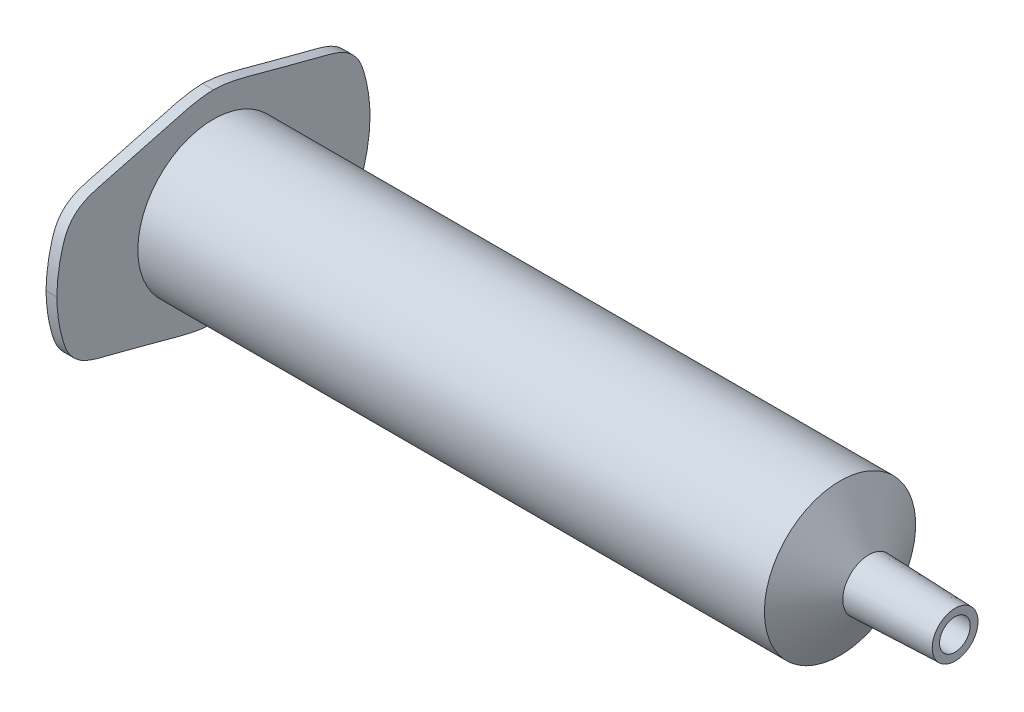
ISO-10303-21;
HEADER;
FILE_DESCRIPTION(('STEP AP214'),'2;1');
FILE_NAME('part.step','',(''),(''),'','','');
FILE_SCHEMA(('AUTOMOTIVE_DESIGN { 1 0 10303 214 1 1 1 1 }'));
ENDSEC;
DATA;
#1=APPLICATION_CONTEXT('core data for automotive mechanical design processes');
#2=APPLICATION_PROTOCOL_DEFINITION('international standard','automotive_design',2000,#1);
#3=PRODUCT_CONTEXT('',#1,'mechanical');
#4=PRODUCT('Part','Part','',(#3));
#5=PRODUCT_RELATED_PRODUCT_CATEGORY('part','',(#4));
#6=PRODUCT_DEFINITION_FORMATION('','',#4);
#7=PRODUCT_DEFINITION_CONTEXT('part definition',#1,'design');
#8=PRODUCT_DEFINITION('design','',#6,#7);
#9=PRODUCT_DEFINITION_SHAPE('','',#8);
#10=(LENGTH_UNIT() NAMED_UNIT(*) SI_UNIT(.MILLI.,.METRE.));
#11=(NAMED_UNIT(*) PLANE_ANGLE_UNIT() SI_UNIT($,.RADIAN.));
#12=(NAMED_UNIT(*) SI_UNIT($,.STERADIAN.) SOLID_ANGLE_UNIT());
#13=UNCERTAINTY_MEASURE_WITH_UNIT(LENGTH_MEASURE(1.E-05),#10,'distance_accuracy_value','');
#14=(GEOMETRIC_REPRESENTATION_CONTEXT(3) GLOBAL_UNCERTAINTY_ASSIGNED_CONTEXT((#13)) GLOBAL_UNIT_ASSIGNED_CONTEXT((#10,
#11,#12)) REPRESENTATION_CONTEXT('',''));
#15=CARTESIAN_POINT('',(0.,0.,0.));
#16=DIRECTION('',(0.,0.,1.));
#17=DIRECTION('',(1.,0.,0.));
#18=AXIS2_PLACEMENT_3D('',#15,#16,#17);
#19=CARTESIAN_POINT('',(18.9012216331777,0.,0.));
#20=DIRECTION('',(-1.,0.,0.));
#21=DIRECTION('',(0.,0.,1.));
#22=AXIS2_PLACEMENT_3D('',#19,#20,#21);
#23=CONICAL_SURFACE('',#22,1.71396799592597,0.0349065850398859);
#24=CARTESIAN_POINT('',(27.2890016001266,0.,0.));
#25=DIRECTION('',(-1.,0.,0.));
#26=DIRECTION('',(0.,0.,1.));
#27=AXIS2_PLACEMENT_3D('',#24,#25,#26);
#28=CIRCLE('',#27,1.42106026515266);
#29=CARTESIAN_POINT('',(27.2890016001266,0.,1.42106026515266));
#30=VERTEX_POINT('',#29);
#31=EDGE_CURVE('E176',#30,#30,#28,.T.);
#32=ORIENTED_EDGE('',*,*,#31,.F.);
#33=EDGE_LOOP('',(#32));
#34=FACE_BOUND('',#33,.T.);
#35=CARTESIAN_POINT('',(18.9012216331777,0.,0.));
#36=DIRECTION('',(-1.,0.,0.));
#37=DIRECTION('',(0.,0.,1.));
#38=AXIS2_PLACEMENT_3D('',#35,#36,#37);
#39=CIRCLE('',#38,1.71396799592597);
#40=CARTESIAN_POINT('',(18.9012216331777,0.,1.71396799592597));
#41=VERTEX_POINT('',#40);
#42=EDGE_CURVE('E11',#41,#41,#39,.T.);
#43=ORIENTED_EDGE('',*,*,#42,.T.);
#44=EDGE_LOOP('',(#43));
#45=FACE_BOUND('',#44,.T.);
#46=ADVANCED_FACE('F40',(#34,#45),#23,.F.);
#47=CARTESIAN_POINT('',(16.2534748211133,0.,0.));
#48=DIRECTION('',(-1.,0.,0.));
#49=DIRECTION('',(0.,0.,1.));
#50=AXIS2_PLACEMENT_3D('',#47,#48,#49);
#51=CONICAL_SURFACE('',#50,6.3,1.0471975511966);
#52=ORIENTED_EDGE('',*,*,#42,.F.);
#53=EDGE_LOOP('',(#52));
#54=FACE_BOUND('',#53,.T.);
#55=CARTESIAN_POINT('',(16.2534748211133,0.,0.));
#56=DIRECTION('',(-1.,0.,0.));
#57=DIRECTION('',(0.,0.,1.));
#58=AXIS2_PLACEMENT_3D('',#55,#56,#57);
#59=CIRCLE('',#58,6.3);
#60=CARTESIAN_POINT('',(16.2534748211133,0.,6.3));
#61=VERTEX_POINT('',#60);
#62=EDGE_CURVE('E48',#61,#61,#59,.T.);
#63=ORIENTED_EDGE('',*,*,#62,.T.);
#64=EDGE_LOOP('',(#63));
#65=FACE_BOUND('',#64,.T.);
#66=ADVANCED_FACE('F193',(#54,#65),#51,.F.);
#67=CARTESIAN_POINT('',(-11.5652905987812,0.,0.));
#68=DIRECTION('',(-1.,0.,0.));
#69=DIRECTION('',(0.,0.,1.));
#70=AXIS2_PLACEMENT_3D('',#67,#68,#69);
#71=CYLINDRICAL_SURFACE('',#70,6.3);
#72=ORIENTED_EDGE('',*,*,#62,.F.);
#73=EDGE_LOOP('',(#72));
#74=FACE_BOUND('',#73,.T.);
#75=CARTESIAN_POINT('',(-42.342379990454,0.,0.));
#76=DIRECTION('',(-1.,0.,0.));
#77=DIRECTION('',(0.,0.,1.));
#78=AXIS2_PLACEMENT_3D('',#75,#76,#77);
#79=CIRCLE('',#78,6.3);
#80=CARTESIAN_POINT('',(-42.342379990454,0.,6.3));
#81=VERTEX_POINT('',#80);
#82=EDGE_CURVE('E139',#81,#81,#79,.T.);
#83=ORIENTED_EDGE('',*,*,#82,.T.);
#84=EDGE_LOOP('',(#83));
#85=FACE_BOUND('',#84,.T.);
#86=ADVANCED_FACE('F195',(#74,#85),#71,.F.);
#87=CARTESIAN_POINT('',(-11.5652905987812,0.,0.));
#88=DIRECTION('',(-1.,0.,0.));
#89=DIRECTION('',(0.,0.,1.));
#90=AXIS2_PLACEMENT_3D('',#87,#88,#89);
#91=CYLINDRICAL_SURFACE('',#90,7.);
#92=CARTESIAN_POINT('',(16.657620009546,0.,0.));
#93=DIRECTION('',(-1.,0.,0.));
#94=DIRECTION('',(0.,0.,1.));
#95=AXIS2_PLACEMENT_3D('',#92,#93,#94);
#96=CIRCLE('',#95,7.);
#97=CARTESIAN_POINT('',(16.657620009546,0.,7.));
#98=VERTEX_POINT('',#97);
#99=EDGE_CURVE('E185',#98,#98,#96,.T.);
#100=ORIENTED_EDGE('',*,*,#99,.T.);
#101=EDGE_LOOP('',(#100));
#102=FACE_BOUND('',#101,.T.);
#103=CARTESIAN_POINT('',(-41.342379990454,0.,0.));
#104=DIRECTION('',(-1.,0.,0.));
#105=DIRECTION('',(0.,0.,1.));
#106=AXIS2_PLACEMENT_3D('',#103,#104,#105);
#107=CIRCLE('',#106,7.);
#108=CARTESIAN_POINT('',(-41.342379990454,0.,7.));
#109=VERTEX_POINT('',#108);
#110=EDGE_CURVE('E188',#109,#109,#107,.T.);
#111=ORIENTED_EDGE('',*,*,#110,.F.);
#112=EDGE_LOOP('',(#111));
#113=FACE_BOUND('',#112,.T.);
#114=ADVANCED_FACE('F197',(#102,#113),#91,.T.);
#115=CARTESIAN_POINT('',(16.657620009546,0.,0.));
#116=DIRECTION('',(-1.,0.,0.));
#117=DIRECTION('',(0.,0.,1.));
#118=AXIS2_PLACEMENT_3D('',#115,#116,#117);
#119=CONICAL_SURFACE('',#118,7.,1.0471975511966);
#120=CARTESIAN_POINT('',(19.3134312478183,0.,0.));
#121=DIRECTION('',(-1.,0.,0.));
#122=DIRECTION('',(0.,0.,1.));
#123=AXIS2_PLACEMENT_3D('',#120,#121,#122);
#124=CIRCLE('',#123,2.4);
#125=CARTESIAN_POINT('',(19.3134312478183,0.,2.4));
#126=VERTEX_POINT('',#125);
#127=EDGE_CURVE('E182',#126,#126,#124,.T.);
#128=ORIENTED_EDGE('',*,*,#127,.T.);
#129=EDGE_LOOP('',(#128));
#130=FACE_BOUND('',#129,.T.);
#131=ORIENTED_EDGE('',*,*,#99,.F.);
#132=EDGE_LOOP('',(#131));
#133=FACE_BOUND('',#132,.T.);
#134=ADVANCED_FACE('F204',(#130,#133),#119,.T.);
#135=CARTESIAN_POINT('',(19.3134312478183,0.,0.));
#136=DIRECTION('',(-1.,0.,0.));
#137=DIRECTION('',(0.,0.,1.));
#138=AXIS2_PLACEMENT_3D('',#135,#136,#137);
#139=CONICAL_SURFACE('',#138,2.4,0.0349065850398859);
#140=CARTESIAN_POINT('',(27.3134312478183,0.,0.));
#141=DIRECTION('',(-1.,0.,0.));
#142=DIRECTION('',(0.,0.,1.));
#143=AXIS2_PLACEMENT_3D('',#140,#141,#142);
#144=CIRCLE('',#143,2.12063384406602);
#145=CARTESIAN_POINT('',(27.3134312478183,0.,2.12063384406602));
#146=VERTEX_POINT('',#145);
#147=EDGE_CURVE('E179',#146,#146,#144,.T.);
#148=ORIENTED_EDGE('',*,*,#147,.T.);
#149=EDGE_LOOP('',(#148));
#150=FACE_BOUND('',#149,.T.);
#151=ORIENTED_EDGE('',*,*,#127,.F.);
#152=EDGE_LOOP('',(#151));
#153=FACE_BOUND('',#152,.T.);
#154=ADVANCED_FACE('F218',(#150,#153),#139,.T.);
#155=CARTESIAN_POINT('',(27.3134312478183,0.,0.));
#156=DIRECTION('',(1.,0.,0.));
#157=DIRECTION('',(0.,0.,-1.));
#158=AXIS2_PLACEMENT_3D('',#155,#156,#157);
#159=CONICAL_SURFACE('',#158,2.12063384406602,1.53588974175502);
#160=ORIENTED_EDGE('',*,*,#31,.T.);
#161=EDGE_LOOP('',(#160));
#162=FACE_BOUND('',#161,.T.);
#163=ORIENTED_EDGE('',*,*,#147,.F.);
#164=EDGE_LOOP('',(#163));
#165=FACE_BOUND('',#164,.T.);
#166=ADVANCED_FACE('F133',(#162,#165),#159,.F.);
#167=CARTESIAN_POINT('',(-42.342379990454,7.14812112098861,9.49735171448007));
#168=DIRECTION('',(1.,0.,0.));
#169=DIRECTION('',(0.,0.,-1.));
#170=AXIS2_PLACEMENT_3D('',#167,#168,#169);
#171=PLANE('',#170);
#172=CARTESIAN_POINT('',(-42.342379990454,0.,14.5));
#173=CARTESIAN_POINT('',(-42.342379990454,1.25062948296168,14.4747287337964));
#174=CARTESIAN_POINT('',(-42.342379990454,3.01805845460226,14.2423280061506));
#175=CARTESIAN_POINT('',(-42.342379990454,5.15619286158089,13.4807262176049));
#176=CARTESIAN_POINT('',(-42.342379990454,6.24214820869177,12.3868883358726));
#177=CARTESIAN_POINT('',(-42.342379990454,6.72744437401259,11.1428383642192));
#178=CARTESIAN_POINT('',(-42.342379990454,7.12517911747974,9.56242027490795));
#179=CARTESIAN_POINT('',(-42.342379990454,7.69192172722433,7.48369388502889));
#180=CARTESIAN_POINT('',(-42.342379990454,8.36371994814103,4.7243913483052));
#181=CARTESIAN_POINT('',(-42.342379990454,9.12236681345111,2.26698944585392));
#182=CARTESIAN_POINT('',(-42.342379990454,9.33281421682711,0.655183078614348));
#183=CARTESIAN_POINT('',(-42.342379990454,9.35571143335815,0.0828452476058366));
#184=CARTESIAN_POINT('',(-42.342379990454,9.35788854192528,-1.99968167117032E-08));
#185=B_SPLINE_CURVE_WITH_KNOTS('',3,(#172,#173,#174,#175,#176,#177,#178,#179,#180,#181,#182,
#183,#184),.UNSPECIFIED.,.F.,.F.,(4,1,1,1,1,1,1,1,1,1,4),(0.,0.178779936700054,
0.255445114736818,0.319697761446917,0.392573489005963,0.443879083298232,0.553726463791617,
0.701162756448446,0.851190941881399,0.921407160798108,0.9332864030032),.UNSPECIFIED.);
#186=CARTESIAN_POINT('',(-42.342379990454,0.,14.5));
#187=VERTEX_POINT('',#186);
#188=CARTESIAN_POINT('',(-42.342379990454,9.35788854192528,-1.99968166933079E-08));
#189=VERTEX_POINT('',#188);
#190=EDGE_CURVE('E93',#187,#189,#185,.T.);
#191=ORIENTED_EDGE('',*,*,#190,.T.);
#192=CARTESIAN_POINT('',(-42.342379990454,9.35788854192528,-1.99968166933079E-08));
#193=CARTESIAN_POINT('',(-42.342379990454,9.35571143335814,-0.0828452875993035));
#194=CARTESIAN_POINT('',(-42.342379990454,9.33281469007736,-0.655182958783064));
#195=CARTESIAN_POINT('',(-42.342379990454,9.12236640364072,-2.26698955923304));
#196=CARTESIAN_POINT('',(-42.342379990454,8.36372008924576,-4.72439130790144));
#197=CARTESIAN_POINT('',(-42.342379990454,7.69192169836099,-7.48369389125443));
#198=CARTESIAN_POINT('',(-42.342379990454,7.125179122578,-9.56242027367162));
#199=CARTESIAN_POINT('',(-42.342379990454,6.72744436948187,-11.1428383621854));
#200=CARTESIAN_POINT('',(-42.342379990454,6.24214820092978,-12.3868883306955));
#201=CARTESIAN_POINT('',(-42.342379990454,5.15619285745482,-13.4807262081216));
#202=CARTESIAN_POINT('',(-42.342379990454,3.01805845556055,-14.2423280043153));
#203=CARTESIAN_POINT('',(-42.342379990454,1.25062948209032,-14.4747287271112));
#204=CARTESIAN_POINT('',(-42.342379990454,0.,-14.5));
#205=B_SPLINE_CURVE_WITH_KNOTS('',3,(#192,#193,#194,#195,#196,#197,#198,#199,#200,#201,#202,
#203,#204),.UNSPECIFIED.,.F.,.F.,(4,1,1,1,1,1,1,1,1,1,4),(0.,0.0118792422050917,
0.082095461121801,0.232123646554754,0.379559939211583,0.489407319704968,0.540712913997237,
0.613588641556282,0.677841288266382,0.754506466303146,0.9332864030032),.UNSPECIFIED.);
#206=CARTESIAN_POINT('',(-42.342379990454,0.,-14.5));
#207=VERTEX_POINT('',#206);
#208=EDGE_CURVE('E87',#189,#207,#205,.T.);
#209=ORIENTED_EDGE('',*,*,#208,.T.);
#210=CARTESIAN_POINT('',(-42.342379990454,0.,-14.5));
#211=CARTESIAN_POINT('',(-42.342379990454,-1.25062948209032,-14.4747287271112));
#212=CARTESIAN_POINT('',(-42.342379990454,-3.01805845556055,-14.2423280043153));
#213=CARTESIAN_POINT('',(-42.342379990454,-5.15619285745482,-13.4807262081216));
#214=CARTESIAN_POINT('',(-42.342379990454,-6.24214820092977,-12.3868883306955));
#215=CARTESIAN_POINT('',(-42.342379990454,-6.72744436948187,-11.1428383621854));
#216=CARTESIAN_POINT('',(-42.342379990454,-7.125179122578,-9.56242027367162));
#217=CARTESIAN_POINT('',(-42.342379990454,-7.69192169836099,-7.48369389125443));
#218=CARTESIAN_POINT('',(-42.342379990454,-8.36372008924576,-4.72439130790144));
#219=CARTESIAN_POINT('',(-42.342379990454,-9.12236640364072,-2.26698955923304));
#220=CARTESIAN_POINT('',(-42.342379990454,-9.33281469007735,-0.655182958783064));
#221=CARTESIAN_POINT('',(-42.342379990454,-9.35571143335814,-0.0828452875993035));
#222=CARTESIAN_POINT('',(-42.342379990454,-9.35788854192528,-1.99968166933079E-08));
#223=B_SPLINE_CURVE_WITH_KNOTS('',3,(#210,#211,#212,#213,#214,#215,#216,#217,#218,#219,#220,
#221,#222),.UNSPECIFIED.,.F.,.F.,(4,1,1,1,1,1,1,1,1,1,4),(0.,0.178779936700054,
0.255445114736818,0.319697761446917,0.392573489005963,0.443879083298232,0.553726463791617,
0.701162756448446,0.851190941881399,0.921407160798108,0.9332864030032),.UNSPECIFIED.);
#224=CARTESIAN_POINT('',(-42.342379990454,-9.35788854192528,-1.99968167117032E-08));
#225=VERTEX_POINT('',#224);
#226=EDGE_CURVE('E91',#207,#225,#223,.T.);
#227=ORIENTED_EDGE('',*,*,#226,.T.);
#228=CARTESIAN_POINT('',(-42.342379990454,-9.35788854192528,-1.99968167117032E-08));
#229=CARTESIAN_POINT('',(-42.342379990454,-9.35571143335815,0.0828452476058366));
#230=CARTESIAN_POINT('',(-42.342379990454,-9.33281421682711,0.655183078614348));
#231=CARTESIAN_POINT('',(-42.342379990454,-9.12236681345111,2.26698944585392));
#232=CARTESIAN_POINT('',(-42.342379990454,-8.36371994814103,4.7243913483052));
#233=CARTESIAN_POINT('',(-42.342379990454,-7.69192172722432,7.48369388502889));
#234=CARTESIAN_POINT('',(-42.342379990454,-7.12517911747975,9.56242027490795));
#235=CARTESIAN_POINT('',(-42.342379990454,-6.72744437401259,11.1428383642192));
#236=CARTESIAN_POINT('',(-42.342379990454,-6.24214820869177,12.3868883358726));
#237=CARTESIAN_POINT('',(-42.342379990454,-5.15619286158089,13.4807262176049));
#238=CARTESIAN_POINT('',(-42.342379990454,-3.01805845460226,14.2423280061506));
#239=CARTESIAN_POINT('',(-42.342379990454,-1.25062948296168,14.4747287337964));
#240=CARTESIAN_POINT('',(-42.342379990454,0.,14.5));
#241=B_SPLINE_CURVE_WITH_KNOTS('',3,(#228,#229,#230,#231,#232,#233,#234,#235,#236,#237,#238,
#239,#240),.UNSPECIFIED.,.F.,.F.,(4,1,1,1,1,1,1,1,1,1,4),(0.,0.0118792422050917,
0.082095461121801,0.232123646554754,0.379559939211583,0.489407319704968,0.540712913997237,
0.613588641556282,0.677841288266382,0.754506466303146,0.9332864030032),.UNSPECIFIED.);
#242=EDGE_CURVE('E56',#225,#187,#241,.T.);
#243=ORIENTED_EDGE('',*,*,#242,.T.);
#244=EDGE_LOOP('',(#191,#209,#227,#243));
#245=FACE_BOUND('',#244,.T.);
#246=ORIENTED_EDGE('',*,*,#82,.F.);
#247=EDGE_LOOP('',(#246));
#248=FACE_BOUND('',#247,.T.);
#249=ADVANCED_FACE('F88',(#245,#248),#171,.F.);
#250=CARTESIAN_POINT('',(-41.342379990454,7.14812112098861,9.49735171448007));
#251=DIRECTION('',(1.,0.,0.));
#252=DIRECTION('',(0.,0.,-1.));
#253=AXIS2_PLACEMENT_3D('',#250,#251,#252);
#254=PLANE('',#253);
#255=ORIENTED_EDGE('',*,*,#110,.T.);
#256=EDGE_LOOP('',(#255));
#257=FACE_BOUND('',#256,.T.);
#258=CARTESIAN_POINT('',(-41.342379990454,0.,14.5));
#259=CARTESIAN_POINT('',(-41.342379990454,1.25062948296168,14.4747287337964));
#260=CARTESIAN_POINT('',(-41.342379990454,3.01805845460226,14.2423280061506));
#261=CARTESIAN_POINT('',(-41.342379990454,5.15619286158089,13.4807262176049));
#262=CARTESIAN_POINT('',(-41.342379990454,6.24214820869177,12.3868883358726));
#263=CARTESIAN_POINT('',(-41.342379990454,6.72744437401259,11.1428383642192));
#264=CARTESIAN_POINT('',(-41.342379990454,7.12517911747974,9.56242027490795));
#265=CARTESIAN_POINT('',(-41.342379990454,7.69192172722433,7.48369388502889));
#266=CARTESIAN_POINT('',(-41.342379990454,8.36371994814103,4.7243913483052));
#267=CARTESIAN_POINT('',(-41.342379990454,9.12236681345111,2.26698944585392));
#268=CARTESIAN_POINT('',(-41.342379990454,9.33281421682711,0.655183078614348));
#269=CARTESIAN_POINT('',(-41.342379990454,9.35571143335815,0.0828452476058366));
#270=CARTESIAN_POINT('',(-41.342379990454,9.35788854192528,-1.99968167117032E-08));
#271=B_SPLINE_CURVE_WITH_KNOTS('',3,(#258,#259,#260,#261,#262,#263,#264,#265,#266,#267,#268,
#269,#270),.UNSPECIFIED.,.F.,.F.,(4,1,1,1,1,1,1,1,1,1,4),(0.,0.178779936700054,
0.255445114736818,0.319697761446917,0.392573489005963,0.443879083298232,0.553726463791617,
0.701162756448446,0.851190941881399,0.921407160798108,0.9332864030032),.UNSPECIFIED.);
#272=CARTESIAN_POINT('',(-41.342379990454,0.,14.5));
#273=VERTEX_POINT('',#272);
#274=CARTESIAN_POINT('',(-41.342379990454,9.35788854192528,-1.99968166933079E-08));
#275=VERTEX_POINT('',#274);
#276=EDGE_CURVE('E144',#273,#275,#271,.T.);
#277=ORIENTED_EDGE('',*,*,#276,.F.);
#278=CARTESIAN_POINT('',(-41.342379990454,-9.35788854192528,-1.99968167117032E-08));
#279=CARTESIAN_POINT('',(-41.342379990454,-9.35571143335815,0.0828452476058366));
#280=CARTESIAN_POINT('',(-41.342379990454,-9.33281421682711,0.655183078614348));
#281=CARTESIAN_POINT('',(-41.342379990454,-9.12236681345111,2.26698944585392));
#282=CARTESIAN_POINT('',(-41.342379990454,-8.36371994814103,4.7243913483052));
#283=CARTESIAN_POINT('',(-41.342379990454,-7.69192172722432,7.48369388502889));
#284=CARTESIAN_POINT('',(-41.342379990454,-7.12517911747975,9.56242027490795));
#285=CARTESIAN_POINT('',(-41.342379990454,-6.72744437401259,11.1428383642192));
#286=CARTESIAN_POINT('',(-41.342379990454,-6.24214820869177,12.3868883358726));
#287=CARTESIAN_POINT('',(-41.342379990454,-5.15619286158089,13.4807262176049));
#288=CARTESIAN_POINT('',(-41.342379990454,-3.01805845460226,14.2423280061506));
#289=CARTESIAN_POINT('',(-41.342379990454,-1.25062948296168,14.4747287337964));
#290=CARTESIAN_POINT('',(-41.342379990454,0.,14.5));
#291=B_SPLINE_CURVE_WITH_KNOTS('',3,(#278,#279,#280,#281,#282,#283,#284,#285,#286,#287,#288,
#289,#290),.UNSPECIFIED.,.F.,.F.,(4,1,1,1,1,1,1,1,1,1,4),(0.,0.0118792422050917,
0.082095461121801,0.232123646554754,0.379559939211583,0.489407319704968,0.540712913997237,
0.613588641556282,0.677841288266382,0.754506466303146,0.9332864030032),.UNSPECIFIED.);
#292=CARTESIAN_POINT('',(-41.342379990454,-9.35788854192528,-1.99968167117032E-08));
#293=VERTEX_POINT('',#292);
#294=EDGE_CURVE('E79',#293,#273,#291,.T.);
#295=ORIENTED_EDGE('',*,*,#294,.F.);
#296=CARTESIAN_POINT('',(-41.342379990454,0.,-14.5));
#297=CARTESIAN_POINT('',(-41.342379990454,-1.25062948209032,-14.4747287271112));
#298=CARTESIAN_POINT('',(-41.342379990454,-3.01805845556055,-14.2423280043153));
#299=CARTESIAN_POINT('',(-41.342379990454,-5.15619285745482,-13.4807262081216));
#300=CARTESIAN_POINT('',(-41.342379990454,-6.24214820092977,-12.3868883306955));
#301=CARTESIAN_POINT('',(-41.342379990454,-6.72744436948187,-11.1428383621854));
#302=CARTESIAN_POINT('',(-41.342379990454,-7.125179122578,-9.56242027367162));
#303=CARTESIAN_POINT('',(-41.342379990454,-7.69192169836099,-7.48369389125443));
#304=CARTESIAN_POINT('',(-41.342379990454,-8.36372008924576,-4.72439130790144));
#305=CARTESIAN_POINT('',(-41.342379990454,-9.12236640364072,-2.26698955923304));
#306=CARTESIAN_POINT('',(-41.342379990454,-9.33281469007735,-0.655182958783064));
#307=CARTESIAN_POINT('',(-41.342379990454,-9.35571143335814,-0.0828452875993035));
#308=CARTESIAN_POINT('',(-41.342379990454,-9.35788854192528,-1.99968166933079E-08));
#309=B_SPLINE_CURVE_WITH_KNOTS('',3,(#296,#297,#298,#299,#300,#301,#302,#303,#304,#305,#306,
#307,#308),.UNSPECIFIED.,.F.,.F.,(4,1,1,1,1,1,1,1,1,1,4),(0.,0.178779936700054,
0.255445114736818,0.319697761446917,0.392573489005963,0.443879083298232,0.553726463791617,
0.701162756448446,0.851190941881399,0.921407160798108,0.9332864030032),.UNSPECIFIED.);
#310=CARTESIAN_POINT('',(-41.342379990454,0.,-14.5));
#311=VERTEX_POINT('',#310);
#312=EDGE_CURVE('E73',#311,#293,#309,.T.);
#313=ORIENTED_EDGE('',*,*,#312,.F.);
#314=CARTESIAN_POINT('',(-41.342379990454,9.35788854192528,-1.99968166933079E-08));
#315=CARTESIAN_POINT('',(-41.342379990454,9.35571143335814,-0.0828452875993035));
#316=CARTESIAN_POINT('',(-41.342379990454,9.33281469007736,-0.655182958783064));
#317=CARTESIAN_POINT('',(-41.342379990454,9.12236640364072,-2.26698955923304));
#318=CARTESIAN_POINT('',(-41.342379990454,8.36372008924576,-4.72439130790144));
#319=CARTESIAN_POINT('',(-41.342379990454,7.69192169836099,-7.48369389125443));
#320=CARTESIAN_POINT('',(-41.342379990454,7.125179122578,-9.56242027367162));
#321=CARTESIAN_POINT('',(-41.342379990454,6.72744436948187,-11.1428383621854));
#322=CARTESIAN_POINT('',(-41.342379990454,6.24214820092978,-12.3868883306955));
#323=CARTESIAN_POINT('',(-41.342379990454,5.15619285745482,-13.4807262081216));
#324=CARTESIAN_POINT('',(-41.342379990454,3.01805845556055,-14.2423280043153));
#325=CARTESIAN_POINT('',(-41.342379990454,1.25062948209032,-14.4747287271112));
#326=CARTESIAN_POINT('',(-41.342379990454,0.,-14.5));
#327=B_SPLINE_CURVE_WITH_KNOTS('',3,(#314,#315,#316,#317,#318,#319,#320,#321,#322,#323,#324,
#325,#326),.UNSPECIFIED.,.F.,.F.,(4,1,1,1,1,1,1,1,1,1,4),(0.,0.0118792422050917,
0.082095461121801,0.232123646554754,0.379559939211583,0.489407319704968,0.540712913997237,
0.613588641556282,0.677841288266382,0.754506466303146,0.9332864030032),.UNSPECIFIED.);
#328=EDGE_CURVE('E98',#275,#311,#327,.T.);
#329=ORIENTED_EDGE('',*,*,#328,.F.);
#330=EDGE_LOOP('',(#277,#295,#313,#329));
#331=FACE_BOUND('',#330,.T.);
#332=ADVANCED_FACE('F131',(#257,#331),#254,.T.);
#333=DIRECTION('',(1.,0.,0.));
#334=VECTOR('',#333,1.);
#335=SURFACE_OF_LINEAR_EXTRUSION('',#185,#334);
#336=ORIENTED_EDGE('',*,*,#276,.T.);
#337=DIRECTION('',(1.,0.,0.));
#338=VECTOR('',#337,1.);
#339=CARTESIAN_POINT('',(-42.342379990454,9.35788854192528,-1.99968166933079E-08));
#340=LINE('',#339,#338);
#341=EDGE_CURVE('E99',#189,#275,#340,.T.);
#342=ORIENTED_EDGE('',*,*,#341,.F.);
#343=ORIENTED_EDGE('',*,*,#190,.F.);
#344=DIRECTION('',(1.,0.,0.));
#345=VECTOR('',#344,1.);
#346=CARTESIAN_POINT('',(-42.342379990454,0.,14.5));
#347=LINE('',#346,#345);
#348=EDGE_CURVE('E104',#187,#273,#347,.T.);
#349=ORIENTED_EDGE('',*,*,#348,.T.);
#350=EDGE_LOOP('',(#336,#342,#343,#349));
#351=FACE_BOUND('',#350,.T.);
#352=ADVANCED_FACE('F128',(#351),#335,.F.);
#353=DIRECTION('',(1.,0.,0.));
#354=VECTOR('',#353,1.);
#355=SURFACE_OF_LINEAR_EXTRUSION('',#205,#354);
#356=ORIENTED_EDGE('',*,*,#328,.T.);
#357=DIRECTION('',(1.,0.,0.));
#358=VECTOR('',#357,1.);
#359=CARTESIAN_POINT('',(-42.342379990454,0.,-14.5));
#360=LINE('',#359,#358);
#361=EDGE_CURVE('E96',#207,#311,#360,.T.);
#362=ORIENTED_EDGE('',*,*,#361,.F.);
#363=ORIENTED_EDGE('',*,*,#208,.F.);
#364=ORIENTED_EDGE('',*,*,#341,.T.);
#365=EDGE_LOOP('',(#356,#362,#363,#364));
#366=FACE_BOUND('',#365,.T.);
#367=ADVANCED_FACE('F97',(#366),#355,.F.);
#368=DIRECTION('',(1.,0.,0.));
#369=VECTOR('',#368,1.);
#370=SURFACE_OF_LINEAR_EXTRUSION('',#223,#369);
#371=ORIENTED_EDGE('',*,*,#312,.T.);
#372=DIRECTION('',(1.,0.,0.));
#373=VECTOR('',#372,1.);
#374=CARTESIAN_POINT('',(-42.342379990454,-9.35788854192528,-1.99968167117032E-08));
#375=LINE('',#374,#373);
#376=EDGE_CURVE('E100',#225,#293,#375,.T.);
#377=ORIENTED_EDGE('',*,*,#376,.F.);
#378=ORIENTED_EDGE('',*,*,#226,.F.);
#379=ORIENTED_EDGE('',*,*,#361,.T.);
#380=EDGE_LOOP('',(#371,#377,#378,#379));
#381=FACE_BOUND('',#380,.T.);
#382=ADVANCED_FACE('F102',(#381),#370,.F.);
#383=DIRECTION('',(1.,0.,0.));
#384=VECTOR('',#383,1.);
#385=SURFACE_OF_LINEAR_EXTRUSION('',#241,#384);
#386=ORIENTED_EDGE('',*,*,#294,.T.);
#387=ORIENTED_EDGE('',*,*,#348,.F.);
#388=ORIENTED_EDGE('',*,*,#242,.F.);
#389=ORIENTED_EDGE('',*,*,#376,.T.);
#390=EDGE_LOOP('',(#386,#387,#388,#389));
#391=FACE_BOUND('',#390,.T.);
#392=ADVANCED_FACE('F124',(#391),#385,.F.);
#393=CLOSED_SHELL('',(#46,#66,#86,#114,#134,#154,#166,#249,#332,#352,#367,#382,#392));
#394=MANIFOLD_SOLID_BREP('B2',#393);
#395=ADVANCED_BREP_SHAPE_REPRESENTATION('',(#18,#394),#14);
#396=SHAPE_DEFINITION_REPRESENTATION(#9,#395);
ENDSEC;
END-ISO-10303-21;
